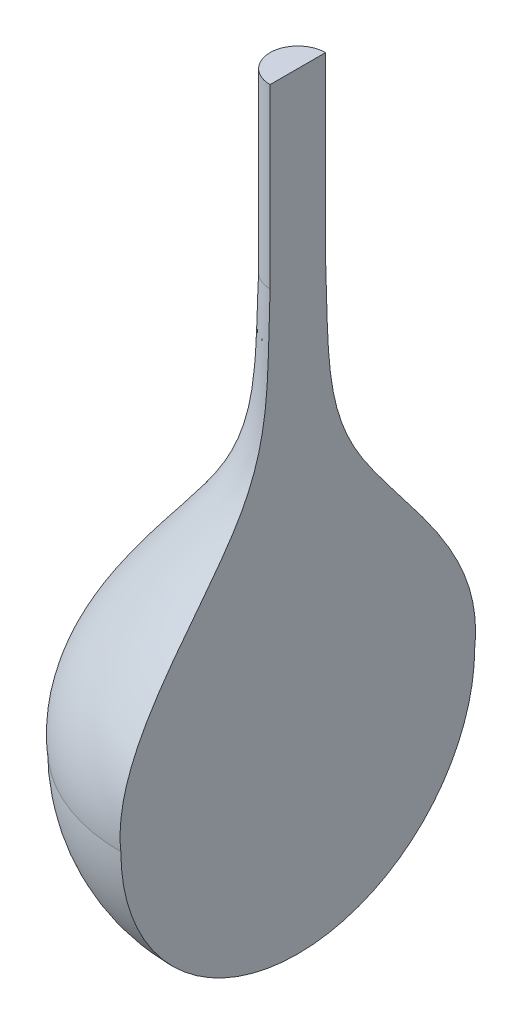
ISO-10303-21;
HEADER;
FILE_DESCRIPTION(('STEP AP214'),'2;1');
FILE_NAME('part.step','',(''),(''),'','','');
FILE_SCHEMA(('AUTOMOTIVE_DESIGN { 1 0 10303 214 1 1 1 1 }'));
ENDSEC;
DATA;
#1=APPLICATION_CONTEXT('core data for automotive mechanical design processes');
#2=APPLICATION_PROTOCOL_DEFINITION('international standard','automotive_design',2000,#1);
#3=PRODUCT_CONTEXT('',#1,'mechanical');
#4=PRODUCT('Part','Part','',(#3));
#5=PRODUCT_RELATED_PRODUCT_CATEGORY('part','',(#4));
#6=PRODUCT_DEFINITION_FORMATION('','',#4);
#7=PRODUCT_DEFINITION_CONTEXT('part definition',#1,'design');
#8=PRODUCT_DEFINITION('design','',#6,#7);
#9=PRODUCT_DEFINITION_SHAPE('','',#8);
#10=(LENGTH_UNIT() NAMED_UNIT(*) SI_UNIT(.MILLI.,.METRE.));
#11=(NAMED_UNIT(*) PLANE_ANGLE_UNIT() SI_UNIT($,.RADIAN.));
#12=(NAMED_UNIT(*) SI_UNIT($,.STERADIAN.) SOLID_ANGLE_UNIT());
#13=UNCERTAINTY_MEASURE_WITH_UNIT(LENGTH_MEASURE(1.E-05),#10,'distance_accuracy_value','');
#14=(GEOMETRIC_REPRESENTATION_CONTEXT(3) GLOBAL_UNCERTAINTY_ASSIGNED_CONTEXT((#13)) GLOBAL_UNIT_ASSIGNED_CONTEXT((#10,
#11,#12)) REPRESENTATION_CONTEXT('',''));
#15=CARTESIAN_POINT('',(0.,0.,0.));
#16=DIRECTION('',(0.,0.,1.));
#17=DIRECTION('',(1.,0.,0.));
#18=AXIS2_PLACEMENT_3D('',#15,#16,#17);
#19=CARTESIAN_POINT('',(0.,-7.01388888888889,0.));
#20=DIRECTION('',(0.,1.,0.));
#21=DIRECTION('',(-1.,0.,0.));
#22=AXIS2_PLACEMENT_3D('',#19,#20,#21);
#23=SPHERICAL_SURFACE('',#22,15.);
#24=CARTESIAN_POINT('',(0.,-7.01388888888889,0.));
#25=DIRECTION('',(1.,0.,0.));
#26=DIRECTION('',(0.,0.,-1.));
#27=AXIS2_PLACEMENT_3D('',#24,#25,#26);
#28=CIRCLE('',#27,15.);
#29=CARTESIAN_POINT('',(0.,-7.01388888888889,15.));
#30=VERTEX_POINT('',#29);
#31=CARTESIAN_POINT('',(0.,-7.01388888888892,-15.));
#32=VERTEX_POINT('',#31);
#33=EDGE_CURVE('E102',#30,#32,#28,.T.);
#34=ORIENTED_EDGE('',*,*,#33,.F.);
#35=CARTESIAN_POINT('',(0.,-7.01388888888889,0.));
#36=DIRECTION('',(0.,1.,0.));
#37=DIRECTION('',(-1.,0.,0.));
#38=AXIS2_PLACEMENT_3D('',#35,#36,#37);
#39=CIRCLE('',#38,15.);
#40=EDGE_CURVE('E40',#32,#30,#39,.T.);
#41=ORIENTED_EDGE('',*,*,#40,.F.);
#42=EDGE_LOOP('',(#34,#41));
#43=FACE_BOUND('',#42,.T.);
#44=ADVANCED_FACE('F33',(#43),#23,.T.);
#45=CARTESIAN_POINT('',(2.35,27.9861111111111,0.));
#46=CARTESIAN_POINT('',(2.59984726436997,21.3904229868889,0.));
#47=CARTESIAN_POINT('',(1.84969286806134,12.0966979561686,0.));
#48=CARTESIAN_POINT('',(15.8550897938963,0.539943119276071,0.));
#49=CARTESIAN_POINT('',(15.,-7.01388888888892,0.));
#50=B_SPLINE_CURVE_WITH_KNOTS('',3,(#45,#46,#47,#48,#49),.UNSPECIFIED.,.F.,.F.,(4,1,4),(0.,
0.452531854902088,1.),.UNSPECIFIED.);
#51=CARTESIAN_POINT('',(0.,27.9861111111111,0.));
#52=DIRECTION('',(0.,1.,0.));
#53=AXIS1_PLACEMENT('',#51,#52);
#54=SURFACE_OF_REVOLUTION('',#50,#53);
#55=CARTESIAN_POINT('',(0.,27.9861111111111,0.));
#56=DIRECTION('',(0.,1.,0.));
#57=DIRECTION('',(-1.,0.,0.));
#58=AXIS2_PLACEMENT_3D('',#55,#56,#57);
#59=CIRCLE('',#58,2.35);
#60=CARTESIAN_POINT('',(0.,27.9861111111111,-2.35));
#61=VERTEX_POINT('',#60);
#62=CARTESIAN_POINT('',(0.,27.9861111111111,2.35));
#63=VERTEX_POINT('',#62);
#64=EDGE_CURVE('E71',#61,#63,#59,.T.);
#65=ORIENTED_EDGE('',*,*,#64,.F.);
#66=CARTESIAN_POINT('',(0.,27.9861111111111,-2.35));
#67=CARTESIAN_POINT('',(0.,21.3904229868889,-2.59984726436997));
#68=CARTESIAN_POINT('',(0.,12.0966979561686,-1.84969286806134));
#69=CARTESIAN_POINT('',(0.,0.539943119276069,-15.8550897938963));
#70=CARTESIAN_POINT('',(0.,-7.01388888888892,-15.));
#71=B_SPLINE_CURVE_WITH_KNOTS('',3,(#66,#67,#68,#69,#70),.UNSPECIFIED.,.F.,.F.,(4,1,4),(0.,
0.452531854902088,1.),.UNSPECIFIED.);
#72=EDGE_CURVE('E105',#61,#32,#71,.T.);
#73=ORIENTED_EDGE('',*,*,#72,.T.);
#74=ORIENTED_EDGE('',*,*,#40,.T.);
#75=CARTESIAN_POINT('',(0.,27.9861111111111,2.35));
#76=CARTESIAN_POINT('',(0.,21.3904229868889,2.59984726436997));
#77=CARTESIAN_POINT('',(0.,12.0966979561686,1.84969286806134));
#78=CARTESIAN_POINT('',(0.,0.539943119276069,15.8550897938963));
#79=CARTESIAN_POINT('',(0.,-7.01388888888892,15.));
#80=B_SPLINE_CURVE_WITH_KNOTS('',3,(#75,#76,#77,#78,#79),.UNSPECIFIED.,.F.,.F.,(4,1,4),(0.,
0.452531854902088,1.),.UNSPECIFIED.);
#81=EDGE_CURVE('E72',#30,#63,#80,.F.);
#82=ORIENTED_EDGE('',*,*,#81,.T.);
#83=EDGE_LOOP('',(#65,#73,#74,#82));
#84=FACE_BOUND('',#83,.T.);
#85=ADVANCED_FACE('F85',(#84),#54,.F.);
#86=CARTESIAN_POINT('',(0.,42.9861111111111,0.));
#87=DIRECTION('',(0.,-1.,0.));
#88=DIRECTION('',(1.,0.,0.));
#89=AXIS2_PLACEMENT_3D('',#86,#87,#88);
#90=CYLINDRICAL_SURFACE('',#89,2.35);
#91=DIRECTION('',(0.,-1.,0.));
#92=VECTOR('',#91,1.);
#93=CARTESIAN_POINT('',(0.,42.9861111111111,2.35));
#94=LINE('',#93,#92);
#95=CARTESIAN_POINT('',(0.,42.9861111111111,2.35));
#96=VERTEX_POINT('',#95);
#97=EDGE_CURVE('E52',#96,#63,#94,.T.);
#98=ORIENTED_EDGE('',*,*,#97,.F.);
#99=CARTESIAN_POINT('',(0.,42.9861111111111,0.));
#100=DIRECTION('',(0.,1.,0.));
#101=DIRECTION('',(-1.,0.,0.));
#102=AXIS2_PLACEMENT_3D('',#99,#100,#101);
#103=CIRCLE('',#102,2.35);
#104=CARTESIAN_POINT('',(0.,42.9861111111111,-2.35));
#105=VERTEX_POINT('',#104);
#106=EDGE_CURVE('E69',#105,#96,#103,.T.);
#107=ORIENTED_EDGE('',*,*,#106,.F.);
#108=DIRECTION('',(0.,-1.,0.));
#109=VECTOR('',#108,1.);
#110=CARTESIAN_POINT('',(0.,42.9861111111111,-2.35));
#111=LINE('',#110,#109);
#112=EDGE_CURVE('E47',#61,#105,#111,.F.);
#113=ORIENTED_EDGE('',*,*,#112,.F.);
#114=ORIENTED_EDGE('',*,*,#64,.T.);
#115=EDGE_LOOP('',(#98,#107,#113,#114));
#116=FACE_BOUND('',#115,.T.);
#117=ADVANCED_FACE('F68',(#116),#90,.T.);
#118=CARTESIAN_POINT('',(0.,42.9861111111111,0.));
#119=DIRECTION('',(0.,1.,0.));
#120=DIRECTION('',(-1.,0.,0.));
#121=AXIS2_PLACEMENT_3D('',#118,#119,#120);
#122=PLANE('',#121);
#123=ORIENTED_EDGE('',*,*,#106,.T.);
#124=DIRECTION('',(0.,0.,-1.));
#125=VECTOR('',#124,1.);
#126=CARTESIAN_POINT('',(0.,42.9861111111111,0.));
#127=LINE('',#126,#125);
#128=EDGE_CURVE('E11',#96,#105,#127,.T.);
#129=ORIENTED_EDGE('',*,*,#128,.T.);
#130=EDGE_LOOP('',(#123,#129));
#131=FACE_BOUND('',#130,.T.);
#132=ADVANCED_FACE('F74',(#131),#122,.T.);
#133=CARTESIAN_POINT('',(0.,0.,25.));
#134=DIRECTION('',(1.,0.,0.));
#135=DIRECTION('',(0.,0.,-1.));
#136=AXIS2_PLACEMENT_3D('',#133,#134,#135);
#137=PLANE('',#136);
#138=ORIENTED_EDGE('',*,*,#97,.T.);
#139=ORIENTED_EDGE('',*,*,#81,.F.);
#140=ORIENTED_EDGE('',*,*,#33,.T.);
#141=ORIENTED_EDGE('',*,*,#72,.F.);
#142=ORIENTED_EDGE('',*,*,#112,.T.);
#143=ORIENTED_EDGE('',*,*,#128,.F.);
#144=EDGE_LOOP('',(#138,#139,#140,#141,#142,#143));
#145=FACE_BOUND('',#144,.T.);
#146=ADVANCED_FACE('F62',(#145),#137,.T.);
#147=CLOSED_SHELL('',(#44,#85,#117,#132,#146));
#148=MANIFOLD_SOLID_BREP('B2',#147);
#149=ADVANCED_BREP_SHAPE_REPRESENTATION('',(#18,#148),#14);
#150=SHAPE_DEFINITION_REPRESENTATION(#9,#149);
ENDSEC;
END-ISO-10303-21;
